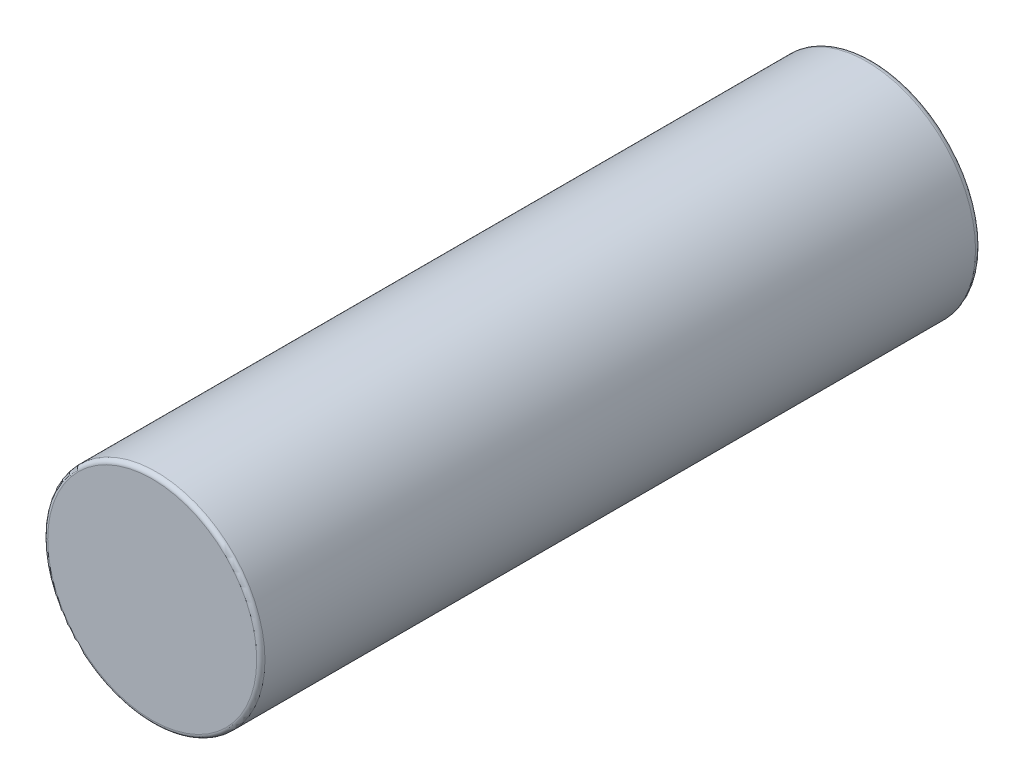
ISO-10303-21;
HEADER;
FILE_DESCRIPTION(('STEP AP214'),'2;1');
FILE_NAME('part.step','',(''),(''),'','','');
FILE_SCHEMA(('AUTOMOTIVE_DESIGN { 1 0 10303 214 1 1 1 1 }'));
ENDSEC;
DATA;
#1=APPLICATION_CONTEXT('core data for automotive mechanical design processes');
#2=APPLICATION_PROTOCOL_DEFINITION('international standard','automotive_design',2000,#1);
#3=PRODUCT_CONTEXT('',#1,'mechanical');
#4=PRODUCT('Part','Part','',(#3));
#5=PRODUCT_RELATED_PRODUCT_CATEGORY('part','',(#4));
#6=PRODUCT_DEFINITION_FORMATION('','',#4);
#7=PRODUCT_DEFINITION_CONTEXT('part definition',#1,'design');
#8=PRODUCT_DEFINITION('design','',#6,#7);
#9=PRODUCT_DEFINITION_SHAPE('','',#8);
#10=(LENGTH_UNIT() NAMED_UNIT(*) SI_UNIT(.MILLI.,.METRE.));
#11=(NAMED_UNIT(*) PLANE_ANGLE_UNIT() SI_UNIT($,.RADIAN.));
#12=(NAMED_UNIT(*) SI_UNIT($,.STERADIAN.) SOLID_ANGLE_UNIT());
#13=UNCERTAINTY_MEASURE_WITH_UNIT(LENGTH_MEASURE(1.E-05),#10,'distance_accuracy_value','');
#14=(GEOMETRIC_REPRESENTATION_CONTEXT(3) GLOBAL_UNCERTAINTY_ASSIGNED_CONTEXT((#13)) GLOBAL_UNIT_ASSIGNED_CONTEXT((#10,
#11,#12)) REPRESENTATION_CONTEXT('',''));
#15=CARTESIAN_POINT('',(0.,0.,0.));
#16=DIRECTION('',(0.,0.,1.));
#17=DIRECTION('',(1.,0.,0.));
#18=AXIS2_PLACEMENT_3D('',#15,#16,#17);
#19=CARTESIAN_POINT('',(0.,0.,-70.09));
#20=DIRECTION('',(0.,0.,-1.));
#21=DIRECTION('',(-1.,0.,0.));
#22=AXIS2_PLACEMENT_3D('',#19,#20,#21);
#23=PLANE('',#22);
#24=CARTESIAN_POINT('',(0.,0.,-70.09));
#25=DIRECTION('',(0.,0.,1.));
#26=DIRECTION('',(1.,0.,0.));
#27=AXIS2_PLACEMENT_3D('',#24,#25,#26);
#28=CIRCLE('',#27,4.39217757019907);
#29=CARTESIAN_POINT('',(4.39217757019907,0.,-70.09));
#30=VERTEX_POINT('',#29);
#31=EDGE_CURVE('E46',#30,#30,#28,.T.);
#32=ORIENTED_EDGE('',*,*,#31,.F.);
#33=EDGE_LOOP('',(#32));
#34=FACE_BOUND('',#33,.T.);
#35=ADVANCED_FACE('F34',(#34),#23,.T.);
#36=CARTESIAN_POINT('',(0.,0.,-69.89));
#37=DIRECTION('',(0.,0.,1.));
#38=DIRECTION('',(1.,0.,0.));
#39=AXIS2_PLACEMENT_3D('',#36,#37,#38);
#40=TOROIDAL_SURFACE('',#39,4.39217757019907,0.200000000000004);
#41=ORIENTED_EDGE('',*,*,#31,.T.);
#42=EDGE_LOOP('',(#41));
#43=FACE_BOUND('',#42,.T.);
#44=CARTESIAN_POINT('',(0.,0.,-69.9999233002953));
#45=DIRECTION('',(0.,0.,1.));
#46=DIRECTION('',(1.,0.,0.));
#47=AXIS2_PLACEMENT_3D('',#44,#45,#46);
#48=CIRCLE('',#47,4.55926098664786);
#49=CARTESIAN_POINT('',(4.55926098664786,0.,-69.9999233002953));
#50=VERTEX_POINT('',#49);
#51=EDGE_CURVE('E50',#50,#50,#48,.T.);
#52=ORIENTED_EDGE('',*,*,#51,.F.);
#53=EDGE_LOOP('',(#52));
#54=FACE_BOUND('',#53,.T.);
#55=ADVANCED_FACE('F111',(#43,#54),#40,.T.);
#56=CARTESIAN_POINT('',(0.,0.,-68.6600766997047));
#57=DIRECTION('',(0.,0.,1.));
#58=DIRECTION('',(1.,0.,0.));
#59=AXIS2_PLACEMENT_3D('',#56,#57,#58);
#60=CONICAL_SURFACE('',#59,5.44073901335214,0.581905118139888);
#61=ORIENTED_EDGE('',*,*,#51,.T.);
#62=EDGE_LOOP('',(#61));
#63=FACE_BOUND('',#62,.T.);
#64=CARTESIAN_POINT('',(0.,0.,-68.6600766997047));
#65=DIRECTION('',(0.,0.,1.));
#66=DIRECTION('',(1.,0.,0.));
#67=AXIS2_PLACEMENT_3D('',#64,#65,#66);
#68=CIRCLE('',#67,5.44073901335214);
#69=CARTESIAN_POINT('',(5.44073901335214,0.,-68.6600766997047));
#70=VERTEX_POINT('',#69);
#71=EDGE_CURVE('E55',#70,#70,#68,.T.);
#72=ORIENTED_EDGE('',*,*,#71,.F.);
#73=EDGE_LOOP('',(#72));
#74=FACE_BOUND('',#73,.T.);
#75=ADVANCED_FACE('F117',(#63,#74),#60,.T.);
#76=CARTESIAN_POINT('',(0.,0.,-68.77));
#77=DIRECTION('',(0.,0.,1.));
#78=DIRECTION('',(1.,0.,0.));
#79=AXIS2_PLACEMENT_3D('',#76,#77,#78);
#80=TOROIDAL_SURFACE('',#79,5.60782242980093,0.200000000000004);
#81=ORIENTED_EDGE('',*,*,#71,.T.);
#82=EDGE_LOOP('',(#81));
#83=FACE_BOUND('',#82,.T.);
#84=CARTESIAN_POINT('',(0.,0.,-68.57));
#85=DIRECTION('',(0.,0.,1.));
#86=DIRECTION('',(1.,0.,0.));
#87=AXIS2_PLACEMENT_3D('',#84,#85,#86);
#88=CIRCLE('',#87,5.60782242980093);
#89=CARTESIAN_POINT('',(5.60782242980093,0.,-68.57));
#90=VERTEX_POINT('',#89);
#91=EDGE_CURVE('E58',#90,#90,#88,.T.);
#92=ORIENTED_EDGE('',*,*,#91,.F.);
#93=EDGE_LOOP('',(#92));
#94=FACE_BOUND('',#93,.T.);
#95=ADVANCED_FACE('F258',(#83,#94),#80,.F.);
#96=CARTESIAN_POINT('',(6.955,0.,-68.57));
#97=DIRECTION('',(0.,0.,-1.));
#98=DIRECTION('',(-1.,0.,0.));
#99=AXIS2_PLACEMENT_3D('',#96,#97,#98);
#100=PLANE('',#99);
#101=ORIENTED_EDGE('',*,*,#91,.T.);
#102=EDGE_LOOP('',(#101));
#103=FACE_BOUND('',#102,.T.);
#104=CARTESIAN_POINT('',(0.,0.,-68.57));
#105=DIRECTION('',(0.,0.,1.));
#106=DIRECTION('',(1.,0.,0.));
#107=AXIS2_PLACEMENT_3D('',#104,#105,#106);
#108=CIRCLE('',#107,6.955);
#109=CARTESIAN_POINT('',(6.955,0.,-68.57));
#110=VERTEX_POINT('',#109);
#111=EDGE_CURVE('E61',#110,#110,#108,.T.);
#112=ORIENTED_EDGE('',*,*,#111,.F.);
#113=EDGE_LOOP('',(#112));
#114=FACE_BOUND('',#113,.T.);
#115=ADVANCED_FACE('F248',(#103,#114),#100,.T.);
#116=CARTESIAN_POINT('',(0.,0.,0.));
#117=DIRECTION('',(0.,0.,1.));
#118=DIRECTION('',(1.,0.,0.));
#119=AXIS2_PLACEMENT_3D('',#116,#117,#118);
#120=CYLINDRICAL_SURFACE('',#119,6.955);
#121=ORIENTED_EDGE('',*,*,#111,.T.);
#122=EDGE_LOOP('',(#121));
#123=FACE_BOUND('',#122,.T.);
#124=CARTESIAN_POINT('',(0.,0.,-68.67));
#125=DIRECTION('',(0.,0.,1.));
#126=DIRECTION('',(1.,0.,0.));
#127=AXIS2_PLACEMENT_3D('',#124,#125,#126);
#128=CIRCLE('',#127,6.955);
#129=CARTESIAN_POINT('',(6.955,0.,-68.67));
#130=VERTEX_POINT('',#129);
#131=EDGE_CURVE('E64',#130,#130,#128,.T.);
#132=ORIENTED_EDGE('',*,*,#131,.F.);
#133=EDGE_LOOP('',(#132));
#134=FACE_BOUND('',#133,.T.);
#135=ADVANCED_FACE('F238',(#123,#134),#120,.F.);
#136=CARTESIAN_POINT('',(7.745,0.,-68.67));
#137=DIRECTION('',(0.,0.,-1.));
#138=DIRECTION('',(-1.,0.,0.));
#139=AXIS2_PLACEMENT_3D('',#136,#137,#138);
#140=PLANE('',#139);
#141=ORIENTED_EDGE('',*,*,#131,.T.);
#142=EDGE_LOOP('',(#141));
#143=FACE_BOUND('',#142,.T.);
#144=CARTESIAN_POINT('',(0.,0.,-68.67));
#145=DIRECTION('',(0.,0.,1.));
#146=DIRECTION('',(1.,0.,0.));
#147=AXIS2_PLACEMENT_3D('',#144,#145,#146);
#148=CIRCLE('',#147,7.745);
#149=CARTESIAN_POINT('',(7.745,0.,-68.67));
#150=VERTEX_POINT('',#149);
#151=EDGE_CURVE('E67',#150,#150,#148,.T.);
#152=ORIENTED_EDGE('',*,*,#151,.F.);
#153=EDGE_LOOP('',(#152));
#154=FACE_BOUND('',#153,.T.);
#155=ADVANCED_FACE('F227',(#143,#154),#140,.T.);
#156=CARTESIAN_POINT('',(0.,0.,0.));
#157=DIRECTION('',(0.,0.,1.));
#158=DIRECTION('',(1.,0.,0.));
#159=AXIS2_PLACEMENT_3D('',#156,#157,#158);
#160=CYLINDRICAL_SURFACE('',#159,7.745);
#161=ORIENTED_EDGE('',*,*,#151,.T.);
#162=EDGE_LOOP('',(#161));
#163=FACE_BOUND('',#162,.T.);
#164=CARTESIAN_POINT('',(0.,0.,-68.97));
#165=DIRECTION('',(0.,0.,1.));
#166=DIRECTION('',(1.,0.,0.));
#167=AXIS2_PLACEMENT_3D('',#164,#165,#166);
#168=CIRCLE('',#167,7.745);
#169=CARTESIAN_POINT('',(7.745,0.,-68.97));
#170=VERTEX_POINT('',#169);
#171=EDGE_CURVE('E70',#170,#170,#168,.T.);
#172=ORIENTED_EDGE('',*,*,#171,.F.);
#173=EDGE_LOOP('',(#172));
#174=FACE_BOUND('',#173,.T.);
#175=ADVANCED_FACE('F217',(#163,#174),#160,.F.);
#176=CARTESIAN_POINT('',(8.1,0.,-68.97));
#177=DIRECTION('',(0.,0.,-1.));
#178=DIRECTION('',(-1.,0.,0.));
#179=AXIS2_PLACEMENT_3D('',#176,#177,#178);
#180=PLANE('',#179);
#181=ORIENTED_EDGE('',*,*,#171,.T.);
#182=EDGE_LOOP('',(#181));
#183=FACE_BOUND('',#182,.T.);
#184=CARTESIAN_POINT('',(0.,0.,-68.97));
#185=DIRECTION('',(0.,0.,1.));
#186=DIRECTION('',(1.,0.,0.));
#187=AXIS2_PLACEMENT_3D('',#184,#185,#186);
#188=CIRCLE('',#187,8.1);
#189=CARTESIAN_POINT('',(8.1,0.,-68.97));
#190=VERTEX_POINT('',#189);
#191=EDGE_CURVE('E73',#190,#190,#188,.T.);
#192=ORIENTED_EDGE('',*,*,#191,.F.);
#193=EDGE_LOOP('',(#192));
#194=FACE_BOUND('',#193,.T.);
#195=ADVANCED_FACE('F205',(#183,#194),#180,.T.);
#196=CARTESIAN_POINT('',(0.,0.,0.));
#197=DIRECTION('',(0.,0.,1.));
#198=DIRECTION('',(1.,0.,0.));
#199=AXIS2_PLACEMENT_3D('',#196,#197,#198);
#200=CYLINDRICAL_SURFACE('',#199,8.1);
#201=ORIENTED_EDGE('',*,*,#191,.T.);
#202=EDGE_LOOP('',(#201));
#203=FACE_BOUND('',#202,.T.);
#204=CARTESIAN_POINT('',(0.,0.,-69.1559649204977));
#205=DIRECTION('',(0.,0.,1.));
#206=DIRECTION('',(1.,0.,0.));
#207=AXIS2_PLACEMENT_3D('',#204,#205,#206);
#208=CIRCLE('',#207,8.1);
#209=CARTESIAN_POINT('',(8.1,0.,-69.1559649204977));
#210=VERTEX_POINT('',#209);
#211=EDGE_CURVE('E76',#210,#210,#208,.T.);
#212=ORIENTED_EDGE('',*,*,#211,.F.);
#213=EDGE_LOOP('',(#212));
#214=FACE_BOUND('',#213,.T.);
#215=ADVANCED_FACE('F194',(#203,#214),#200,.F.);
#216=CARTESIAN_POINT('',(0.,0.,-69.1559649204977));
#217=DIRECTION('',(0.,0.,1.));
#218=DIRECTION('',(1.,0.,0.));
#219=AXIS2_PLACEMENT_3D('',#216,#217,#218);
#220=TOROIDAL_SURFACE('',#219,8.3,0.2);
#221=ORIENTED_EDGE('',*,*,#211,.T.);
#222=EDGE_LOOP('',(#221));
#223=FACE_BOUND('',#222,.T.);
#224=CARTESIAN_POINT('',(0.,0.,-69.3297818298548));
#225=DIRECTION('',(0.,0.,1.));
#226=DIRECTION('',(1.,0.,0.));
#227=AXIS2_PLACEMENT_3D('',#224,#225,#226);
#228=CIRCLE('',#227,8.20106728538283);
#229=CARTESIAN_POINT('',(8.20106728538283,0.,-69.3297818298548));
#230=VERTEX_POINT('',#229);
#231=EDGE_CURVE('E79',#230,#230,#228,.T.);
#232=ORIENTED_EDGE('',*,*,#231,.F.);
#233=EDGE_LOOP('',(#232));
#234=FACE_BOUND('',#233,.T.);
#235=ADVANCED_FACE('F184',(#223,#234),#220,.T.);
#236=CARTESIAN_POINT('',(0.,0.,-66.2746153846157));
#237=DIRECTION('',(0.,0.,1.));
#238=DIRECTION('',(1.,0.,0.));
#239=AXIS2_PLACEMENT_3D('',#236,#237,#238);
#240=TOROIDAL_SURFACE('',#239,9.93999999999989,3.51538461538427);
#241=ORIENTED_EDGE('',*,*,#231,.T.);
#242=EDGE_LOOP('',(#241));
#243=FACE_BOUND('',#242,.T.);
#244=CARTESIAN_POINT('',(0.,0.,-69.79));
#245=DIRECTION('',(0.,0.,1.));
#246=DIRECTION('',(1.,0.,0.));
#247=AXIS2_PLACEMENT_3D('',#244,#245,#246);
#248=CIRCLE('',#247,9.94);
#249=CARTESIAN_POINT('',(9.94,0.,-69.79));
#250=VERTEX_POINT('',#249);
#251=EDGE_CURVE('E82',#250,#250,#248,.T.);
#252=ORIENTED_EDGE('',*,*,#251,.F.);
#253=EDGE_LOOP('',(#252));
#254=FACE_BOUND('',#253,.T.);
#255=ADVANCED_FACE('F174',(#243,#254),#240,.T.);
#256=CARTESIAN_POINT('',(0.,0.,-69.21));
#257=DIRECTION('',(0.,0.,1.));
#258=DIRECTION('',(1.,0.,0.));
#259=AXIS2_PLACEMENT_3D('',#256,#257,#258);
#260=TOROIDAL_SURFACE('',#259,9.94,0.579999999999999);
#261=ORIENTED_EDGE('',*,*,#251,.T.);
#262=EDGE_LOOP('',(#261));
#263=FACE_BOUND('',#262,.T.);
#264=CARTESIAN_POINT('',(0.,0.,-69.21));
#265=DIRECTION('',(0.,0.,1.));
#266=DIRECTION('',(1.,0.,0.));
#267=AXIS2_PLACEMENT_3D('',#264,#265,#266);
#268=CIRCLE('',#267,10.52);
#269=CARTESIAN_POINT('',(10.52,0.,-69.21));
#270=VERTEX_POINT('',#269);
#271=EDGE_CURVE('E85',#270,#270,#268,.T.);
#272=ORIENTED_EDGE('',*,*,#271,.F.);
#273=EDGE_LOOP('',(#272));
#274=FACE_BOUND('',#273,.T.);
#275=ADVANCED_FACE('F107',(#263,#274),#260,.T.);
#276=CARTESIAN_POINT('',(0.,0.,0.));
#277=DIRECTION('',(0.,0.,1.));
#278=DIRECTION('',(1.,0.,0.));
#279=AXIS2_PLACEMENT_3D('',#276,#277,#278);
#280=CYLINDRICAL_SURFACE('',#279,10.52);
#281=ORIENTED_EDGE('',*,*,#271,.T.);
#282=EDGE_LOOP('',(#281));
#283=FACE_BOUND('',#282,.T.);
#284=CARTESIAN_POINT('',(0.,0.,-0.400000000000003));
#285=DIRECTION('',(0.,0.,1.));
#286=DIRECTION('',(1.,0.,0.));
#287=AXIS2_PLACEMENT_3D('',#284,#285,#286);
#288=CIRCLE('',#287,10.52);
#289=CARTESIAN_POINT('',(10.52,0.,-0.400000000000003));
#290=VERTEX_POINT('',#289);
#291=EDGE_CURVE('E88',#290,#290,#288,.T.);
#292=ORIENTED_EDGE('',*,*,#291,.F.);
#293=EDGE_LOOP('',(#292));
#294=FACE_BOUND('',#293,.T.);
#295=ADVANCED_FACE('F99',(#283,#294),#280,.T.);
#296=CARTESIAN_POINT('',(0.,0.,-0.4));
#297=DIRECTION('',(0.,0.,1.));
#298=DIRECTION('',(1.,0.,0.));
#299=AXIS2_PLACEMENT_3D('',#296,#297,#298);
#300=TOROIDAL_SURFACE('',#299,10.12,0.4);
#301=ORIENTED_EDGE('',*,*,#291,.T.);
#302=EDGE_LOOP('',(#301));
#303=FACE_BOUND('',#302,.T.);
#304=CARTESIAN_POINT('',(0.,0.,0.));
#305=DIRECTION('',(0.,0.,1.));
#306=DIRECTION('',(1.,0.,0.));
#307=AXIS2_PLACEMENT_3D('',#304,#305,#306);
#308=CIRCLE('',#307,10.12);
#309=CARTESIAN_POINT('',(10.12,0.,0.));
#310=VERTEX_POINT('',#309);
#311=EDGE_CURVE('E91',#310,#310,#308,.T.);
#312=ORIENTED_EDGE('',*,*,#311,.F.);
#313=EDGE_LOOP('',(#312));
#314=FACE_BOUND('',#313,.T.);
#315=ADVANCED_FACE('F97',(#303,#314),#300,.T.);
#316=CARTESIAN_POINT('',(10.12,0.,0.));
#317=DIRECTION('',(0.,0.,1.));
#318=DIRECTION('',(1.,0.,0.));
#319=AXIS2_PLACEMENT_3D('',#316,#317,#318);
#320=PLANE('',#319);
#321=ORIENTED_EDGE('',*,*,#311,.T.);
#322=EDGE_LOOP('',(#321));
#323=FACE_BOUND('',#322,.T.);
#324=ADVANCED_FACE('F95',(#323),#320,.T.);
#325=CLOSED_SHELL('',(#35,#55,#75,#95,#115,#135,#155,#175,#195,#215,#235,#255,#275,#295,#315,#324));
#326=CARTESIAN_POINT('',(5.3382663552986,0.,-68.27));
#327=DIRECTION('',(0.,0.,-1.));
#328=DIRECTION('',(-1.,0.,0.));
#329=AXIS2_PLACEMENT_3D('',#326,#327,#328);
#330=PLANE('',#329);
#331=CARTESIAN_POINT('',(0.,0.,-68.27));
#332=DIRECTION('',(0.,0.,1.));
#333=DIRECTION('',(1.,0.,0.));
#334=AXIS2_PLACEMENT_3D('',#331,#332,#333);
#335=CIRCLE('',#334,5.3382663552986);
#336=CARTESIAN_POINT('',(5.3382663552986,0.,-68.27));
#337=VERTEX_POINT('',#336);
#338=EDGE_CURVE('E10',#337,#337,#335,.T.);
#339=ORIENTED_EDGE('',*,*,#338,.F.);
#340=EDGE_LOOP('',(#339));
#341=FACE_BOUND('',#340,.T.);
#342=ADVANCED_FACE('F36',(#341),#330,.T.);
#343=CARTESIAN_POINT('',(0.,0.,-69.79));
#344=DIRECTION('',(0.,0.,1.));
#345=DIRECTION('',(1.,0.,0.));
#346=AXIS2_PLACEMENT_3D('',#343,#344,#345);
#347=CONICAL_SURFACE('',#346,4.3382663552986,0.581905118139888);
#348=ORIENTED_EDGE('',*,*,#338,.T.);
#349=EDGE_LOOP('',(#348));
#350=FACE_BOUND('',#349,.T.);
#351=CARTESIAN_POINT('',(0.,0.,-69.79));
#352=DIRECTION('',(0.,0.,1.));
#353=DIRECTION('',(1.,0.,0.));
#354=AXIS2_PLACEMENT_3D('',#351,#352,#353);
#355=CIRCLE('',#354,4.3382663552986);
#356=CARTESIAN_POINT('',(4.3382663552986,0.,-69.79));
#357=VERTEX_POINT('',#356);
#358=EDGE_CURVE('E42',#357,#357,#355,.T.);
#359=ORIENTED_EDGE('',*,*,#358,.F.);
#360=EDGE_LOOP('',(#359));
#361=FACE_BOUND('',#360,.T.);
#362=ADVANCED_FACE('F125',(#350,#361),#347,.F.);
#363=CARTESIAN_POINT('',(0.,0.,-69.79));
#364=DIRECTION('',(0.,0.,1.));
#365=DIRECTION('',(1.,0.,0.));
#366=AXIS2_PLACEMENT_3D('',#363,#364,#365);
#367=PLANE('',#366);
#368=ORIENTED_EDGE('',*,*,#358,.T.);
#369=EDGE_LOOP('',(#368));
#370=FACE_BOUND('',#369,.T.);
#371=ADVANCED_FACE('F123',(#370),#367,.T.);
#372=CLOSED_SHELL('',(#342,#362,#371));
#373=ORIENTED_CLOSED_SHELL('',*,#372,.T.);
#374=BREP_WITH_VOIDS('B2',#325,(#373));
#375=ADVANCED_BREP_SHAPE_REPRESENTATION('',(#18,#374),#14);
#376=SHAPE_DEFINITION_REPRESENTATION(#9,#375);
ENDSEC;
END-ISO-10303-21;
